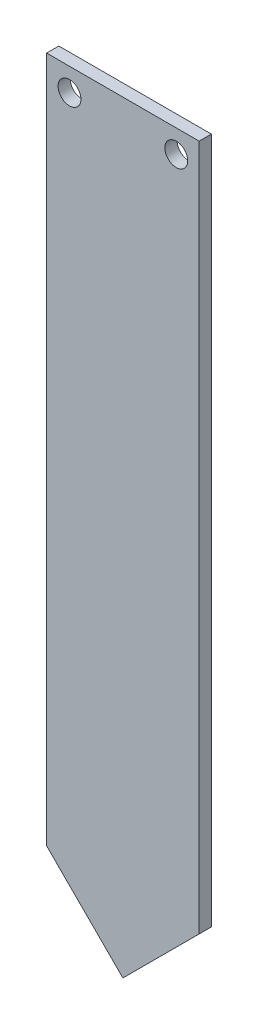
ISO-10303-21;
HEADER;
FILE_DESCRIPTION(('STEP AP214'),'2;1');
FILE_NAME('part.step','',(''),(''),'','','');
FILE_SCHEMA(('AUTOMOTIVE_DESIGN { 1 0 10303 214 1 1 1 1 }'));
ENDSEC;
DATA;
#1=APPLICATION_CONTEXT('core data for automotive mechanical design processes');
#2=APPLICATION_PROTOCOL_DEFINITION('international standard','automotive_design',2000,#1);
#3=PRODUCT_CONTEXT('',#1,'mechanical');
#4=PRODUCT('Part','Part','',(#3));
#5=PRODUCT_RELATED_PRODUCT_CATEGORY('part','',(#4));
#6=PRODUCT_DEFINITION_FORMATION('','',#4);
#7=PRODUCT_DEFINITION_CONTEXT('part definition',#1,'design');
#8=PRODUCT_DEFINITION('design','',#6,#7);
#9=PRODUCT_DEFINITION_SHAPE('','',#8);
#10=(LENGTH_UNIT() NAMED_UNIT(*) SI_UNIT(.MILLI.,.METRE.));
#11=(NAMED_UNIT(*) PLANE_ANGLE_UNIT() SI_UNIT($,.RADIAN.));
#12=(NAMED_UNIT(*) SI_UNIT($,.STERADIAN.) SOLID_ANGLE_UNIT());
#13=UNCERTAINTY_MEASURE_WITH_UNIT(LENGTH_MEASURE(1.E-05),#10,'distance_accuracy_value','');
#14=(GEOMETRIC_REPRESENTATION_CONTEXT(3) GLOBAL_UNCERTAINTY_ASSIGNED_CONTEXT((#13)) GLOBAL_UNIT_ASSIGNED_CONTEXT((#10,
#11,#12)) REPRESENTATION_CONTEXT('',''));
#15=CARTESIAN_POINT('',(0.,0.,0.));
#16=DIRECTION('',(0.,0.,1.));
#17=DIRECTION('',(1.,0.,0.));
#18=AXIS2_PLACEMENT_3D('',#15,#16,#17);
#19=CARTESIAN_POINT('',(0.,0.,1.6));
#20=DIRECTION('',(0.,0.,1.));
#21=DIRECTION('',(1.,0.,0.));
#22=AXIS2_PLACEMENT_3D('',#19,#20,#21);
#23=PLANE('',#22);
#24=CARTESIAN_POINT('',(-7.,42.,1.6));
#25=DIRECTION('',(0.,0.,1.));
#26=DIRECTION('',(1.,0.,0.));
#27=AXIS2_PLACEMENT_3D('',#24,#25,#26);
#28=CIRCLE('',#27,1.5);
#29=CARTESIAN_POINT('',(-5.5,42.,1.6));
#30=VERTEX_POINT('',#29);
#31=EDGE_CURVE('E128',#30,#30,#28,.T.);
#32=ORIENTED_EDGE('',*,*,#31,.F.);
#33=EDGE_LOOP('',(#32));
#34=FACE_BOUND('',#33,.T.);
#35=DIRECTION('',(0.,-1.,0.));
#36=VECTOR('',#35,1.);
#37=CARTESIAN_POINT('',(-10.,45.,1.6));
#38=LINE('',#37,#36);
#39=CARTESIAN_POINT('',(-10.,45.,1.6));
#40=VERTEX_POINT('',#39);
#41=CARTESIAN_POINT('',(-10.,-45.,1.6));
#42=VERTEX_POINT('',#41);
#43=EDGE_CURVE('E137',#40,#42,#38,.T.);
#44=ORIENTED_EDGE('',*,*,#43,.T.);
#45=DIRECTION('',(0.707106781186554,-0.707106781186541,0.));
#46=VECTOR('',#45,1.);
#47=CARTESIAN_POINT('',(0.,-54.9999999999999,1.6));
#48=LINE('',#47,#46);
#49=CARTESIAN_POINT('',(0.,-54.9999999999999,1.6));
#50=VERTEX_POINT('',#49);
#51=EDGE_CURVE('E95',#42,#50,#48,.T.);
#52=ORIENTED_EDGE('',*,*,#51,.T.);
#53=DIRECTION('',(0.707106781186543,0.707106781186552,0.));
#54=VECTOR('',#53,1.);
#55=CARTESIAN_POINT('',(0.,-54.9999999999999,1.6));
#56=LINE('',#55,#54);
#57=CARTESIAN_POINT('',(10.,-44.9999999999998,1.6));
#58=VERTEX_POINT('',#57);
#59=EDGE_CURVE('E99',#50,#58,#56,.T.);
#60=ORIENTED_EDGE('',*,*,#59,.T.);
#61=DIRECTION('',(0.,1.,0.));
#62=VECTOR('',#61,1.);
#63=CARTESIAN_POINT('',(10.,45.,1.6));
#64=LINE('',#63,#62);
#65=CARTESIAN_POINT('',(10.,45.,1.6));
#66=VERTEX_POINT('',#65);
#67=EDGE_CURVE('E103',#58,#66,#64,.T.);
#68=ORIENTED_EDGE('',*,*,#67,.T.);
#69=DIRECTION('',(-1.,0.,0.));
#70=VECTOR('',#69,1.);
#71=CARTESIAN_POINT('',(-10.,45.,1.6));
#72=LINE('',#71,#70);
#73=EDGE_CURVE('E61',#66,#40,#72,.T.);
#74=ORIENTED_EDGE('',*,*,#73,.T.);
#75=EDGE_LOOP('',(#44,#52,#60,#68,#74));
#76=FACE_BOUND('',#75,.T.);
#77=CARTESIAN_POINT('',(7.,42.,1.6));
#78=DIRECTION('',(0.,0.,1.));
#79=DIRECTION('',(1.,0.,0.));
#80=AXIS2_PLACEMENT_3D('',#77,#78,#79);
#81=CIRCLE('',#80,1.5);
#82=CARTESIAN_POINT('',(8.5,42.,1.6));
#83=VERTEX_POINT('',#82);
#84=EDGE_CURVE('E177',#83,#83,#81,.T.);
#85=ORIENTED_EDGE('',*,*,#84,.F.);
#86=EDGE_LOOP('',(#85));
#87=FACE_BOUND('',#86,.T.);
#88=ADVANCED_FACE('F43',(#34,#76,#87),#23,.T.);
#89=CARTESIAN_POINT('',(0.,0.,0.));
#90=DIRECTION('',(0.,0.,1.));
#91=DIRECTION('',(1.,0.,0.));
#92=AXIS2_PLACEMENT_3D('',#89,#90,#91);
#93=PLANE('',#92);
#94=DIRECTION('',(0.,-1.,0.));
#95=VECTOR('',#94,1.);
#96=CARTESIAN_POINT('',(-10.,45.,0.));
#97=LINE('',#96,#95);
#98=CARTESIAN_POINT('',(-10.,45.,0.));
#99=VERTEX_POINT('',#98);
#100=CARTESIAN_POINT('',(-10.,-45.,0.));
#101=VERTEX_POINT('',#100);
#102=EDGE_CURVE('E123',#99,#101,#97,.T.);
#103=ORIENTED_EDGE('',*,*,#102,.F.);
#104=DIRECTION('',(-1.,0.,0.));
#105=VECTOR('',#104,1.);
#106=CARTESIAN_POINT('',(-10.,45.,0.));
#107=LINE('',#106,#105);
#108=CARTESIAN_POINT('',(10.,45.,0.));
#109=VERTEX_POINT('',#108);
#110=EDGE_CURVE('E87',#109,#99,#107,.T.);
#111=ORIENTED_EDGE('',*,*,#110,.F.);
#112=DIRECTION('',(0.,1.,0.));
#113=VECTOR('',#112,1.);
#114=CARTESIAN_POINT('',(10.,45.,0.));
#115=LINE('',#114,#113);
#116=CARTESIAN_POINT('',(10.,-44.9999999999998,0.));
#117=VERTEX_POINT('',#116);
#118=EDGE_CURVE('E81',#117,#109,#115,.T.);
#119=ORIENTED_EDGE('',*,*,#118,.F.);
#120=DIRECTION('',(0.707106781186543,0.707106781186552,0.));
#121=VECTOR('',#120,1.);
#122=CARTESIAN_POINT('',(0.,-54.9999999999999,0.));
#123=LINE('',#122,#121);
#124=CARTESIAN_POINT('',(0.,-54.9999999999999,0.));
#125=VERTEX_POINT('',#124);
#126=EDGE_CURVE('E111',#125,#117,#123,.T.);
#127=ORIENTED_EDGE('',*,*,#126,.F.);
#128=DIRECTION('',(0.707106781186554,-0.707106781186541,0.));
#129=VECTOR('',#128,1.);
#130=CARTESIAN_POINT('',(0.,-54.9999999999999,0.));
#131=LINE('',#130,#129);
#132=EDGE_CURVE('E127',#101,#125,#131,.T.);
#133=ORIENTED_EDGE('',*,*,#132,.F.);
#134=EDGE_LOOP('',(#103,#111,#119,#127,#133));
#135=FACE_BOUND('',#134,.T.);
#136=CARTESIAN_POINT('',(-7.,42.,0.));
#137=DIRECTION('',(0.,0.,1.));
#138=DIRECTION('',(1.,0.,0.));
#139=AXIS2_PLACEMENT_3D('',#136,#137,#138);
#140=CIRCLE('',#139,1.5);
#141=CARTESIAN_POINT('',(-5.5,42.,0.));
#142=VERTEX_POINT('',#141);
#143=EDGE_CURVE('E185',#142,#142,#140,.T.);
#144=ORIENTED_EDGE('',*,*,#143,.T.);
#145=EDGE_LOOP('',(#144));
#146=FACE_BOUND('',#145,.T.);
#147=CARTESIAN_POINT('',(7.,42.,0.));
#148=DIRECTION('',(0.,0.,1.));
#149=DIRECTION('',(1.,0.,0.));
#150=AXIS2_PLACEMENT_3D('',#147,#148,#149);
#151=CIRCLE('',#150,1.5);
#152=CARTESIAN_POINT('',(8.5,42.,0.));
#153=VERTEX_POINT('',#152);
#154=EDGE_CURVE('E180',#153,#153,#151,.T.);
#155=ORIENTED_EDGE('',*,*,#154,.T.);
#156=EDGE_LOOP('',(#155));
#157=FACE_BOUND('',#156,.T.);
#158=ADVANCED_FACE('F144',(#135,#146,#157),#93,.F.);
#159=CARTESIAN_POINT('',(-10.,45.,1.6));
#160=DIRECTION('',(1.,0.,0.));
#161=DIRECTION('',(0.,0.,-1.));
#162=AXIS2_PLACEMENT_3D('',#159,#160,#161);
#163=PLANE('',#162);
#164=ORIENTED_EDGE('',*,*,#102,.T.);
#165=DIRECTION('',(0.,0.,-1.));
#166=VECTOR('',#165,1.);
#167=CARTESIAN_POINT('',(-10.,-45.,1.6));
#168=LINE('',#167,#166);
#169=EDGE_CURVE('E11',#42,#101,#168,.T.);
#170=ORIENTED_EDGE('',*,*,#169,.F.);
#171=ORIENTED_EDGE('',*,*,#43,.F.);
#172=DIRECTION('',(0.,0.,-1.));
#173=VECTOR('',#172,1.);
#174=CARTESIAN_POINT('',(-10.,45.,1.6));
#175=LINE('',#174,#173);
#176=EDGE_CURVE('E119',#40,#99,#175,.T.);
#177=ORIENTED_EDGE('',*,*,#176,.T.);
#178=EDGE_LOOP('',(#164,#170,#171,#177));
#179=FACE_BOUND('',#178,.T.);
#180=ADVANCED_FACE('F45',(#179),#163,.F.);
#181=CARTESIAN_POINT('',(0.,-54.9999999999999,1.6));
#182=DIRECTION('',(0.707106781186541,0.707106781186554,0.));
#183=DIRECTION('',(-0.707106781186554,0.707106781186541,0.));
#184=AXIS2_PLACEMENT_3D('',#181,#182,#183);
#185=PLANE('',#184);
#186=ORIENTED_EDGE('',*,*,#132,.T.);
#187=DIRECTION('',(0.,0.,-1.));
#188=VECTOR('',#187,1.);
#189=CARTESIAN_POINT('',(0.,-54.9999999999999,1.6));
#190=LINE('',#189,#188);
#191=EDGE_CURVE('E53',#50,#125,#190,.T.);
#192=ORIENTED_EDGE('',*,*,#191,.F.);
#193=ORIENTED_EDGE('',*,*,#51,.F.);
#194=ORIENTED_EDGE('',*,*,#169,.T.);
#195=EDGE_LOOP('',(#186,#192,#193,#194));
#196=FACE_BOUND('',#195,.T.);
#197=ADVANCED_FACE('F224',(#196),#185,.F.);
#198=CARTESIAN_POINT('',(0.,-54.9999999999999,1.6));
#199=DIRECTION('',(-0.707106781186552,0.707106781186543,0.));
#200=DIRECTION('',(-0.707106781186543,-0.707106781186552,0.));
#201=AXIS2_PLACEMENT_3D('',#198,#199,#200);
#202=PLANE('',#201);
#203=ORIENTED_EDGE('',*,*,#126,.T.);
#204=DIRECTION('',(0.,0.,-1.));
#205=VECTOR('',#204,1.);
#206=CARTESIAN_POINT('',(10.,-44.9999999999998,1.6));
#207=LINE('',#206,#205);
#208=EDGE_CURVE('E108',#58,#117,#207,.T.);
#209=ORIENTED_EDGE('',*,*,#208,.F.);
#210=ORIENTED_EDGE('',*,*,#59,.F.);
#211=ORIENTED_EDGE('',*,*,#191,.T.);
#212=EDGE_LOOP('',(#203,#209,#210,#211));
#213=FACE_BOUND('',#212,.T.);
#214=ADVANCED_FACE('F109',(#213),#202,.F.);
#215=CARTESIAN_POINT('',(10.,45.,1.6));
#216=DIRECTION('',(-1.,0.,0.));
#217=DIRECTION('',(0.,0.,1.));
#218=AXIS2_PLACEMENT_3D('',#215,#216,#217);
#219=PLANE('',#218);
#220=ORIENTED_EDGE('',*,*,#118,.T.);
#221=DIRECTION('',(0.,0.,-1.));
#222=VECTOR('',#221,1.);
#223=CARTESIAN_POINT('',(10.,45.,1.6));
#224=LINE('',#223,#222);
#225=EDGE_CURVE('E113',#66,#109,#224,.T.);
#226=ORIENTED_EDGE('',*,*,#225,.F.);
#227=ORIENTED_EDGE('',*,*,#67,.F.);
#228=ORIENTED_EDGE('',*,*,#208,.T.);
#229=EDGE_LOOP('',(#220,#226,#227,#228));
#230=FACE_BOUND('',#229,.T.);
#231=ADVANCED_FACE('F115',(#230),#219,.F.);
#232=CARTESIAN_POINT('',(-10.,45.,1.6));
#233=DIRECTION('',(0.,-1.,0.));
#234=DIRECTION('',(0.,0.,-1.));
#235=AXIS2_PLACEMENT_3D('',#232,#233,#234);
#236=PLANE('',#235);
#237=ORIENTED_EDGE('',*,*,#110,.T.);
#238=ORIENTED_EDGE('',*,*,#176,.F.);
#239=ORIENTED_EDGE('',*,*,#73,.F.);
#240=ORIENTED_EDGE('',*,*,#225,.T.);
#241=EDGE_LOOP('',(#237,#238,#239,#240));
#242=FACE_BOUND('',#241,.T.);
#243=ADVANCED_FACE('F149',(#242),#236,.F.);
#244=CARTESIAN_POINT('',(-7.,42.,1.6));
#245=DIRECTION('',(0.,0.,-1.));
#246=DIRECTION('',(-1.,0.,0.));
#247=AXIS2_PLACEMENT_3D('',#244,#245,#246);
#248=CYLINDRICAL_SURFACE('',#247,1.5);
#249=ORIENTED_EDGE('',*,*,#31,.T.);
#250=EDGE_LOOP('',(#249));
#251=FACE_BOUND('',#250,.T.);
#252=ORIENTED_EDGE('',*,*,#143,.F.);
#253=EDGE_LOOP('',(#252));
#254=FACE_BOUND('',#253,.T.);
#255=ADVANCED_FACE('F151',(#251,#254),#248,.F.);
#256=CARTESIAN_POINT('',(7.,42.,1.6));
#257=DIRECTION('',(0.,0.,-1.));
#258=DIRECTION('',(-1.,0.,0.));
#259=AXIS2_PLACEMENT_3D('',#256,#257,#258);
#260=CYLINDRICAL_SURFACE('',#259,1.5);
#261=ORIENTED_EDGE('',*,*,#84,.T.);
#262=EDGE_LOOP('',(#261));
#263=FACE_BOUND('',#262,.T.);
#264=ORIENTED_EDGE('',*,*,#154,.F.);
#265=EDGE_LOOP('',(#264));
#266=FACE_BOUND('',#265,.T.);
#267=ADVANCED_FACE('F157',(#263,#266),#260,.F.);
#268=CLOSED_SHELL('',(#88,#158,#180,#197,#214,#231,#243,#255,#267));
#269=MANIFOLD_SOLID_BREP('B2',#268);
#270=ADVANCED_BREP_SHAPE_REPRESENTATION('',(#18,#269),#14);
#271=SHAPE_DEFINITION_REPRESENTATION(#9,#270);
ENDSEC;
END-ISO-10303-21;
